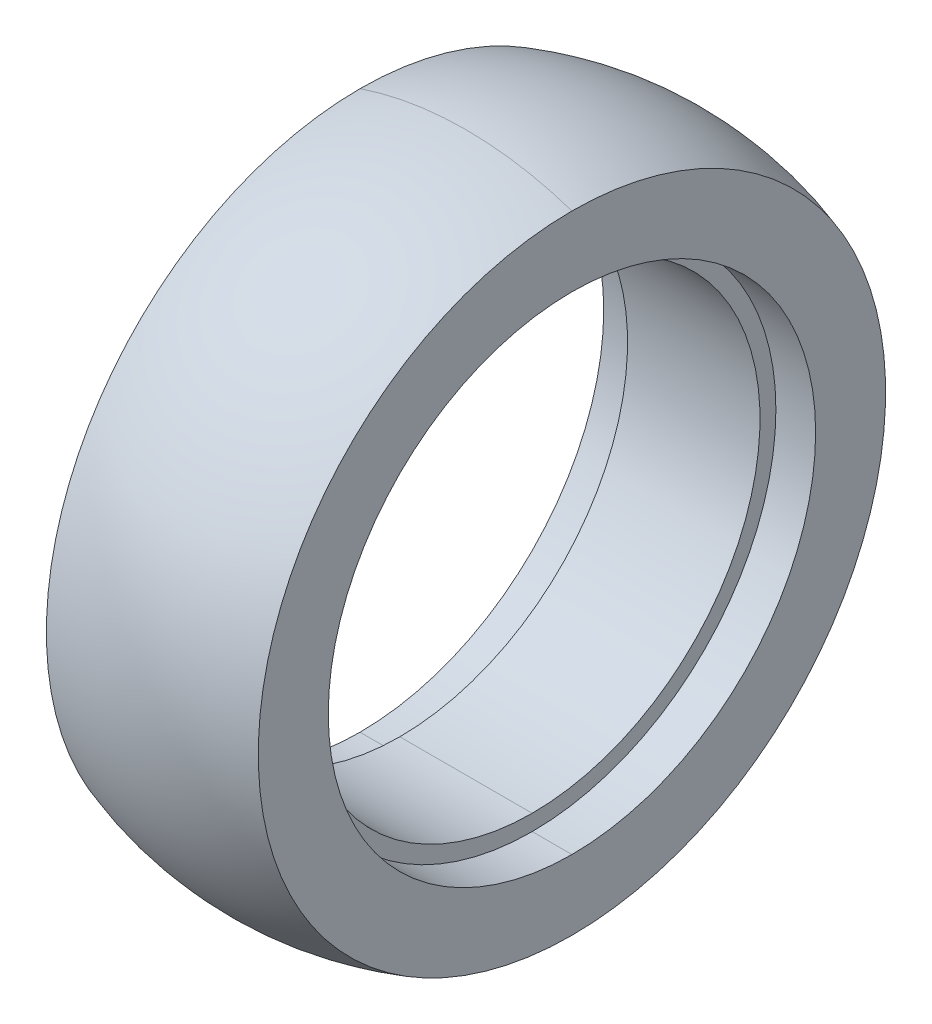
ISO-10303-21;
HEADER;
FILE_DESCRIPTION(('STEP AP214'),'2;1');
FILE_NAME('part.step','',(''),(''),'','','');
FILE_SCHEMA(('AUTOMOTIVE_DESIGN { 1 0 10303 214 1 1 1 1 }'));
ENDSEC;
DATA;
#1=APPLICATION_CONTEXT('core data for automotive mechanical design processes');
#2=APPLICATION_PROTOCOL_DEFINITION('international standard','automotive_design',2000,#1);
#3=PRODUCT_CONTEXT('',#1,'mechanical');
#4=PRODUCT('Part','Part','',(#3));
#5=PRODUCT_RELATED_PRODUCT_CATEGORY('part','',(#4));
#6=PRODUCT_DEFINITION_FORMATION('','',#4);
#7=PRODUCT_DEFINITION_CONTEXT('part definition',#1,'design');
#8=PRODUCT_DEFINITION('design','',#6,#7);
#9=PRODUCT_DEFINITION_SHAPE('','',#8);
#10=(LENGTH_UNIT() NAMED_UNIT(*) SI_UNIT(.MILLI.,.METRE.));
#11=(NAMED_UNIT(*) PLANE_ANGLE_UNIT() SI_UNIT($,.RADIAN.));
#12=(NAMED_UNIT(*) SI_UNIT($,.STERADIAN.) SOLID_ANGLE_UNIT());
#13=UNCERTAINTY_MEASURE_WITH_UNIT(LENGTH_MEASURE(1.E-05),#10,'distance_accuracy_value','');
#14=(GEOMETRIC_REPRESENTATION_CONTEXT(3) GLOBAL_UNCERTAINTY_ASSIGNED_CONTEXT((#13)) GLOBAL_UNIT_ASSIGNED_CONTEXT((#10,
#11,#12)) REPRESENTATION_CONTEXT('',''));
#15=CARTESIAN_POINT('',(0.,0.,0.));
#16=DIRECTION('',(0.,0.,1.));
#17=DIRECTION('',(1.,0.,0.));
#18=AXIS2_PLACEMENT_3D('',#15,#16,#17);
#19=CARTESIAN_POINT('',(20.,0.,0.));
#20=DIRECTION('',(1.,0.,0.));
#21=DIRECTION('',(0.,-1.,0.));
#22=AXIS2_PLACEMENT_3D('',#19,#20,#21);
#23=PLANE('',#22);
#24=CARTESIAN_POINT('',(20.,0.,0.));
#25=DIRECTION('',(1.,0.,0.));
#26=DIRECTION('',(0.,-1.,0.));
#27=AXIS2_PLACEMENT_3D('',#24,#25,#26);
#28=CIRCLE('',#27,46.);
#29=CARTESIAN_POINT('',(20.,-46.,0.));
#30=VERTEX_POINT('',#29);
#31=CARTESIAN_POINT('',(20.,46.,0.));
#32=VERTEX_POINT('',#31);
#33=EDGE_CURVE('E11',#30,#32,#28,.T.);
#34=ORIENTED_EDGE('',*,*,#33,.F.);
#35=CARTESIAN_POINT('',(20.,0.,0.));
#36=DIRECTION('',(-1.,0.,0.));
#37=DIRECTION('',(0.,-1.,0.));
#38=AXIS2_PLACEMENT_3D('',#35,#36,#37);
#39=CIRCLE('',#38,46.);
#40=EDGE_CURVE('E23',#30,#32,#39,.T.);
#41=ORIENTED_EDGE('',*,*,#40,.T.);
#42=EDGE_LOOP('',(#34,#41));
#43=FACE_BOUND('',#42,.T.);
#44=CARTESIAN_POINT('',(20.,0.,0.));
#45=DIRECTION('',(-1.,0.,0.));
#46=DIRECTION('',(0.,-1.,0.));
#47=AXIS2_PLACEMENT_3D('',#44,#45,#46);
#48=CIRCLE('',#47,59.2135964116351);
#49=CARTESIAN_POINT('',(20.,-59.2135964116351,0.));
#50=VERTEX_POINT('',#49);
#51=CARTESIAN_POINT('',(20.,59.213596411635,0.));
#52=VERTEX_POINT('',#51);
#53=EDGE_CURVE('E87',#50,#52,#48,.T.);
#54=ORIENTED_EDGE('',*,*,#53,.F.);
#55=CARTESIAN_POINT('',(20.,0.,0.));
#56=DIRECTION('',(1.,0.,0.));
#57=DIRECTION('',(0.,-1.,0.));
#58=AXIS2_PLACEMENT_3D('',#55,#56,#57);
#59=CIRCLE('',#58,59.2135964116351);
#60=EDGE_CURVE('E136',#50,#52,#59,.T.);
#61=ORIENTED_EDGE('',*,*,#60,.T.);
#62=EDGE_LOOP('',(#54,#61));
#63=FACE_BOUND('',#62,.T.);
#64=ADVANCED_FACE('F16',(#43,#63),#23,.T.);
#65=CARTESIAN_POINT('',(-22.,0.,0.));
#66=DIRECTION('',(1.,0.,0.));
#67=DIRECTION('',(0.,-1.,0.));
#68=AXIS2_PLACEMENT_3D('',#65,#66,#67);
#69=CYLINDRICAL_SURFACE('',#68,46.);
#70=DIRECTION('',(-1.,0.,0.));
#71=VECTOR('',#70,1.);
#72=CARTESIAN_POINT('',(20.,46.,0.));
#73=LINE('',#72,#71);
#74=CARTESIAN_POINT('',(12.5,46.,0.));
#75=VERTEX_POINT('',#74);
#76=EDGE_CURVE('E133',#32,#75,#73,.T.);
#77=ORIENTED_EDGE('',*,*,#76,.F.);
#78=ORIENTED_EDGE('',*,*,#40,.F.);
#79=DIRECTION('',(-1.,0.,0.));
#80=VECTOR('',#79,1.);
#81=CARTESIAN_POINT('',(20.,-46.,0.));
#82=LINE('',#81,#80);
#83=CARTESIAN_POINT('',(12.5,-46.,0.));
#84=VERTEX_POINT('',#83);
#85=EDGE_CURVE('E131',#30,#84,#82,.T.);
#86=ORIENTED_EDGE('',*,*,#85,.T.);
#87=CARTESIAN_POINT('',(12.5,0.,0.));
#88=DIRECTION('',(1.,0.,0.));
#89=DIRECTION('',(0.,1.,0.));
#90=AXIS2_PLACEMENT_3D('',#87,#88,#89);
#91=CIRCLE('',#90,46.);
#92=EDGE_CURVE('E128',#75,#84,#91,.T.);
#93=ORIENTED_EDGE('',*,*,#92,.F.);
#94=EDGE_LOOP('',(#77,#78,#86,#93));
#95=FACE_BOUND('',#94,.T.);
#96=ADVANCED_FACE('F141',(#95),#69,.F.);
#97=CARTESIAN_POINT('',(-22.,0.,0.));
#98=DIRECTION('',(1.,0.,0.));
#99=DIRECTION('',(0.,-1.,0.));
#100=AXIS2_PLACEMENT_3D('',#97,#98,#99);
#101=CYLINDRICAL_SURFACE('',#100,46.);
#102=ORIENTED_EDGE('',*,*,#85,.F.);
#103=ORIENTED_EDGE('',*,*,#33,.T.);
#104=ORIENTED_EDGE('',*,*,#76,.T.);
#105=CARTESIAN_POINT('',(12.5,0.,0.));
#106=DIRECTION('',(1.,0.,0.));
#107=DIRECTION('',(0.,-1.,0.));
#108=AXIS2_PLACEMENT_3D('',#105,#106,#107);
#109=CIRCLE('',#108,46.);
#110=EDGE_CURVE('E125',#84,#75,#109,.T.);
#111=ORIENTED_EDGE('',*,*,#110,.F.);
#112=EDGE_LOOP('',(#102,#103,#104,#111));
#113=FACE_BOUND('',#112,.T.);
#114=ADVANCED_FACE('F147',(#113),#101,.F.);
#115=CARTESIAN_POINT('',(12.5,0.,0.));
#116=DIRECTION('',(1.,0.,0.));
#117=DIRECTION('',(0.,1.,0.));
#118=AXIS2_PLACEMENT_3D('',#115,#116,#117);
#119=PLANE('',#118);
#120=CARTESIAN_POINT('',(12.5,0.,0.));
#121=DIRECTION('',(-1.,0.,0.));
#122=DIRECTION('',(0.,-1.,0.));
#123=AXIS2_PLACEMENT_3D('',#120,#121,#122);
#124=CIRCLE('',#123,43.);
#125=CARTESIAN_POINT('',(12.5,-43.,0.));
#126=VERTEX_POINT('',#125);
#127=CARTESIAN_POINT('',(12.5,43.,0.));
#128=VERTEX_POINT('',#127);
#129=EDGE_CURVE('E123',#126,#128,#124,.T.);
#130=ORIENTED_EDGE('',*,*,#129,.T.);
#131=CARTESIAN_POINT('',(12.5,0.,0.));
#132=DIRECTION('',(-1.,0.,0.));
#133=DIRECTION('',(0.,1.,0.));
#134=AXIS2_PLACEMENT_3D('',#131,#132,#133);
#135=CIRCLE('',#134,43.);
#136=EDGE_CURVE('E121',#128,#126,#135,.T.);
#137=ORIENTED_EDGE('',*,*,#136,.T.);
#138=EDGE_LOOP('',(#130,#137));
#139=FACE_BOUND('',#138,.T.);
#140=ORIENTED_EDGE('',*,*,#92,.T.);
#141=ORIENTED_EDGE('',*,*,#110,.T.);
#142=EDGE_LOOP('',(#140,#141));
#143=FACE_BOUND('',#142,.T.);
#144=ADVANCED_FACE('F153',(#139,#143),#119,.T.);
#145=CARTESIAN_POINT('',(-12.5,0.,0.));
#146=DIRECTION('',(1.,0.,0.));
#147=DIRECTION('',(0.,1.,0.));
#148=AXIS2_PLACEMENT_3D('',#145,#146,#147);
#149=CYLINDRICAL_SURFACE('',#148,43.);
#150=DIRECTION('',(1.,0.,0.));
#151=VECTOR('',#150,1.);
#152=CARTESIAN_POINT('',(-12.5,43.,0.));
#153=LINE('',#152,#151);
#154=CARTESIAN_POINT('',(-12.5,43.,0.));
#155=VERTEX_POINT('',#154);
#156=EDGE_CURVE('E118',#155,#128,#153,.T.);
#157=ORIENTED_EDGE('',*,*,#156,.T.);
#158=ORIENTED_EDGE('',*,*,#129,.F.);
#159=DIRECTION('',(1.,0.,0.));
#160=VECTOR('',#159,1.);
#161=CARTESIAN_POINT('',(-12.5,-43.,0.));
#162=LINE('',#161,#160);
#163=CARTESIAN_POINT('',(-12.5,-43.,0.));
#164=VERTEX_POINT('',#163);
#165=EDGE_CURVE('E115',#164,#126,#162,.T.);
#166=ORIENTED_EDGE('',*,*,#165,.F.);
#167=CARTESIAN_POINT('',(-12.5,0.,0.));
#168=DIRECTION('',(-1.,0.,0.));
#169=DIRECTION('',(0.,-1.,0.));
#170=AXIS2_PLACEMENT_3D('',#167,#168,#169);
#171=CIRCLE('',#170,43.);
#172=EDGE_CURVE('E113',#164,#155,#171,.T.);
#173=ORIENTED_EDGE('',*,*,#172,.T.);
#174=EDGE_LOOP('',(#157,#158,#166,#173));
#175=FACE_BOUND('',#174,.T.);
#176=ADVANCED_FACE('F159',(#175),#149,.F.);
#177=CARTESIAN_POINT('',(-12.5,0.,0.));
#178=DIRECTION('',(1.,0.,0.));
#179=DIRECTION('',(0.,1.,0.));
#180=AXIS2_PLACEMENT_3D('',#177,#178,#179);
#181=CYLINDRICAL_SURFACE('',#180,43.);
#182=ORIENTED_EDGE('',*,*,#165,.T.);
#183=ORIENTED_EDGE('',*,*,#136,.F.);
#184=ORIENTED_EDGE('',*,*,#156,.F.);
#185=CARTESIAN_POINT('',(-12.5,0.,0.));
#186=DIRECTION('',(-1.,0.,0.));
#187=DIRECTION('',(0.,1.,0.));
#188=AXIS2_PLACEMENT_3D('',#185,#186,#187);
#189=CIRCLE('',#188,43.);
#190=EDGE_CURVE('E110',#155,#164,#189,.T.);
#191=ORIENTED_EDGE('',*,*,#190,.T.);
#192=EDGE_LOOP('',(#182,#183,#184,#191));
#193=FACE_BOUND('',#192,.T.);
#194=ADVANCED_FACE('F163',(#193),#181,.F.);
#195=CARTESIAN_POINT('',(-22.,0.,0.));
#196=DIRECTION('',(1.,0.,0.));
#197=DIRECTION('',(0.,-1.,0.));
#198=AXIS2_PLACEMENT_3D('',#195,#196,#197);
#199=CYLINDRICAL_SURFACE('',#198,46.);
#200=DIRECTION('',(-1.,0.,0.));
#201=VECTOR('',#200,1.);
#202=CARTESIAN_POINT('',(-12.5,-46.,0.));
#203=LINE('',#202,#201);
#204=CARTESIAN_POINT('',(-12.5,-46.,0.));
#205=VERTEX_POINT('',#204);
#206=CARTESIAN_POINT('',(-20.,-46.,0.));
#207=VERTEX_POINT('',#206);
#208=EDGE_CURVE('E108',#205,#207,#203,.T.);
#209=ORIENTED_EDGE('',*,*,#208,.T.);
#210=CARTESIAN_POINT('',(-20.,0.,0.));
#211=DIRECTION('',(-1.,0.,0.));
#212=DIRECTION('',(0.,-1.,0.));
#213=AXIS2_PLACEMENT_3D('',#210,#211,#212);
#214=CIRCLE('',#213,46.);
#215=CARTESIAN_POINT('',(-20.,46.,0.));
#216=VERTEX_POINT('',#215);
#217=EDGE_CURVE('E106',#207,#216,#214,.T.);
#218=ORIENTED_EDGE('',*,*,#217,.T.);
#219=DIRECTION('',(-1.,0.,0.));
#220=VECTOR('',#219,1.);
#221=CARTESIAN_POINT('',(-12.5,46.,0.));
#222=LINE('',#221,#220);
#223=CARTESIAN_POINT('',(-12.5,46.,0.));
#224=VERTEX_POINT('',#223);
#225=EDGE_CURVE('E103',#224,#216,#222,.T.);
#226=ORIENTED_EDGE('',*,*,#225,.F.);
#227=CARTESIAN_POINT('',(-12.5,0.,0.));
#228=DIRECTION('',(1.,0.,0.));
#229=DIRECTION('',(0.,1.,0.));
#230=AXIS2_PLACEMENT_3D('',#227,#228,#229);
#231=CIRCLE('',#230,46.);
#232=EDGE_CURVE('E101',#224,#205,#231,.T.);
#233=ORIENTED_EDGE('',*,*,#232,.T.);
#234=EDGE_LOOP('',(#209,#218,#226,#233));
#235=FACE_BOUND('',#234,.T.);
#236=ADVANCED_FACE('F167',(#235),#199,.F.);
#237=CARTESIAN_POINT('',(-12.5,0.,0.));
#238=DIRECTION('',(1.,0.,0.));
#239=DIRECTION('',(0.,1.,0.));
#240=AXIS2_PLACEMENT_3D('',#237,#238,#239);
#241=PLANE('',#240);
#242=ORIENTED_EDGE('',*,*,#172,.F.);
#243=ORIENTED_EDGE('',*,*,#190,.F.);
#244=EDGE_LOOP('',(#242,#243));
#245=FACE_BOUND('',#244,.T.);
#246=ORIENTED_EDGE('',*,*,#232,.F.);
#247=CARTESIAN_POINT('',(-12.5,0.,0.));
#248=DIRECTION('',(1.,0.,0.));
#249=DIRECTION('',(0.,-1.,0.));
#250=AXIS2_PLACEMENT_3D('',#247,#248,#249);
#251=CIRCLE('',#250,46.);
#252=EDGE_CURVE('E96',#205,#224,#251,.T.);
#253=ORIENTED_EDGE('',*,*,#252,.F.);
#254=EDGE_LOOP('',(#246,#253));
#255=FACE_BOUND('',#254,.T.);
#256=ADVANCED_FACE('F171',(#245,#255),#241,.F.);
#257=CARTESIAN_POINT('',(-22.,0.,0.));
#258=DIRECTION('',(1.,0.,0.));
#259=DIRECTION('',(0.,-1.,0.));
#260=AXIS2_PLACEMENT_3D('',#257,#258,#259);
#261=CYLINDRICAL_SURFACE('',#260,46.);
#262=ORIENTED_EDGE('',*,*,#225,.T.);
#263=CARTESIAN_POINT('',(-20.,0.,0.));
#264=DIRECTION('',(1.,0.,0.));
#265=DIRECTION('',(0.,-1.,0.));
#266=AXIS2_PLACEMENT_3D('',#263,#264,#265);
#267=CIRCLE('',#266,46.);
#268=EDGE_CURVE('E93',#207,#216,#267,.T.);
#269=ORIENTED_EDGE('',*,*,#268,.F.);
#270=ORIENTED_EDGE('',*,*,#208,.F.);
#271=ORIENTED_EDGE('',*,*,#252,.T.);
#272=EDGE_LOOP('',(#262,#269,#270,#271));
#273=FACE_BOUND('',#272,.T.);
#274=ADVANCED_FACE('F175',(#273),#261,.F.);
#275=CARTESIAN_POINT('',(-20.,0.,0.));
#276=DIRECTION('',(1.,0.,0.));
#277=DIRECTION('',(0.,-1.,0.));
#278=AXIS2_PLACEMENT_3D('',#275,#276,#277);
#279=PLANE('',#278);
#280=ORIENTED_EDGE('',*,*,#217,.F.);
#281=ORIENTED_EDGE('',*,*,#268,.T.);
#282=EDGE_LOOP('',(#280,#281));
#283=FACE_BOUND('',#282,.T.);
#284=CARTESIAN_POINT('',(-20.,0.,0.));
#285=DIRECTION('',(1.,0.,0.));
#286=DIRECTION('',(0.,-1.,0.));
#287=AXIS2_PLACEMENT_3D('',#284,#285,#286);
#288=CIRCLE('',#287,59.2135964116351);
#289=CARTESIAN_POINT('',(-20.,-59.2135964116351,0.));
#290=VERTEX_POINT('',#289);
#291=CARTESIAN_POINT('',(-20.,59.2135964116351,0.));
#292=VERTEX_POINT('',#291);
#293=EDGE_CURVE('E78',#290,#292,#288,.T.);
#294=ORIENTED_EDGE('',*,*,#293,.F.);
#295=CARTESIAN_POINT('',(-20.,0.,0.));
#296=DIRECTION('',(-1.,0.,0.));
#297=DIRECTION('',(0.,-1.,0.));
#298=AXIS2_PLACEMENT_3D('',#295,#296,#297);
#299=CIRCLE('',#298,59.2135964116351);
#300=EDGE_CURVE('E74',#290,#292,#299,.T.);
#301=ORIENTED_EDGE('',*,*,#300,.T.);
#302=EDGE_LOOP('',(#294,#301));
#303=FACE_BOUND('',#302,.T.);
#304=ADVANCED_FACE('F76',(#283,#303),#279,.F.);
#305=CARTESIAN_POINT('',(0.,0.,0.));
#306=DIRECTION('',(1.,0.,0.));
#307=DIRECTION('',(0.,-1.,0.));
#308=AXIS2_PLACEMENT_3D('',#305,#306,#307);
#309=SPHERICAL_SURFACE('',#308,62.5);
#310=ORIENTED_EDGE('',*,*,#53,.T.);
#311=CARTESIAN_POINT('',(0.,0.,0.));
#312=DIRECTION('',(0.,0.,-1.));
#313=DIRECTION('',(-0.32,0.947417542586161,0.));
#314=AXIS2_PLACEMENT_3D('',#311,#312,#313);
#315=CIRCLE('',#314,62.5);
#316=EDGE_CURVE('E82',#292,#52,#315,.T.);
#317=ORIENTED_EDGE('',*,*,#316,.F.);
#318=ORIENTED_EDGE('',*,*,#300,.F.);
#319=CARTESIAN_POINT('',(0.,0.,0.));
#320=DIRECTION('',(0.,0.,1.));
#321=DIRECTION('',(-0.32,-0.947417542586161,0.));
#322=AXIS2_PLACEMENT_3D('',#319,#320,#321);
#323=CIRCLE('',#322,62.5);
#324=EDGE_CURVE('E90',#290,#50,#323,.T.);
#325=ORIENTED_EDGE('',*,*,#324,.T.);
#326=EDGE_LOOP('',(#310,#317,#318,#325));
#327=FACE_BOUND('',#326,.T.);
#328=ADVANCED_FACE('F86',(#327),#309,.T.);
#329=CARTESIAN_POINT('',(0.,0.,0.));
#330=DIRECTION('',(1.,0.,0.));
#331=DIRECTION('',(0.,-1.,0.));
#332=AXIS2_PLACEMENT_3D('',#329,#330,#331);
#333=SPHERICAL_SURFACE('',#332,62.5);
#334=ORIENTED_EDGE('',*,*,#293,.T.);
#335=ORIENTED_EDGE('',*,*,#316,.T.);
#336=ORIENTED_EDGE('',*,*,#60,.F.);
#337=ORIENTED_EDGE('',*,*,#324,.F.);
#338=EDGE_LOOP('',(#334,#335,#336,#337));
#339=FACE_BOUND('',#338,.T.);
#340=ADVANCED_FACE('F92',(#339),#333,.T.);
#341=CLOSED_SHELL('',(#64,#96,#114,#144,#176,#194,#236,#256,#274,#304,#328,#340));
#342=MANIFOLD_SOLID_BREP('B1',#341);
#343=ADVANCED_BREP_SHAPE_REPRESENTATION('',(#18,#342),#14);
#344=SHAPE_DEFINITION_REPRESENTATION(#9,#343);
ENDSEC;
END-ISO-10303-21;
